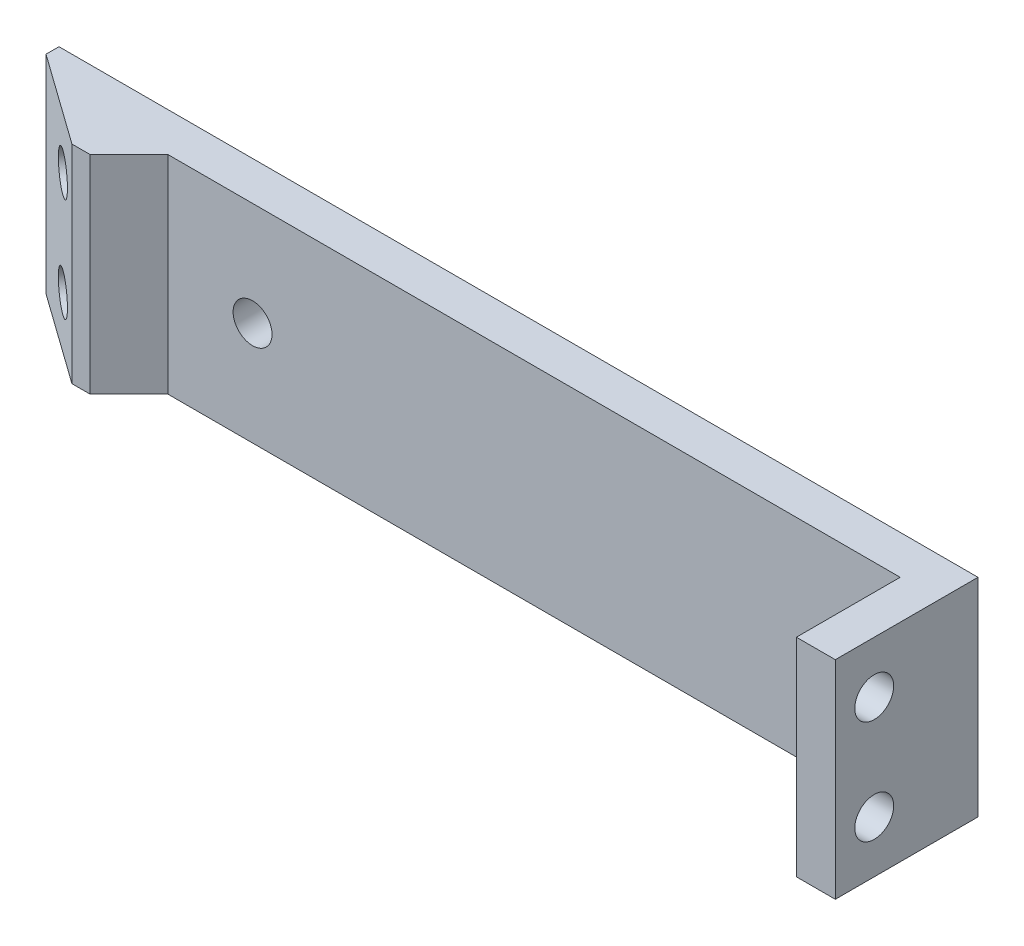
ISO-10303-21;
HEADER;
FILE_DESCRIPTION(('STEP AP214'),'2;1');
FILE_NAME('part.step','',(''),(''),'','','');
FILE_SCHEMA(('AUTOMOTIVE_DESIGN { 1 0 10303 214 1 1 1 1 }'));
ENDSEC;
DATA;
#1=APPLICATION_CONTEXT('core data for automotive mechanical design processes');
#2=APPLICATION_PROTOCOL_DEFINITION('international standard','automotive_design',2000,#1);
#3=PRODUCT_CONTEXT('',#1,'mechanical');
#4=PRODUCT('Part','Part','',(#3));
#5=PRODUCT_RELATED_PRODUCT_CATEGORY('part','',(#4));
#6=PRODUCT_DEFINITION_FORMATION('','',#4);
#7=PRODUCT_DEFINITION_CONTEXT('part definition',#1,'design');
#8=PRODUCT_DEFINITION('design','',#6,#7);
#9=PRODUCT_DEFINITION_SHAPE('','',#8);
#10=(LENGTH_UNIT() NAMED_UNIT(*) SI_UNIT(.MILLI.,.METRE.));
#11=(NAMED_UNIT(*) PLANE_ANGLE_UNIT() SI_UNIT($,.RADIAN.));
#12=(NAMED_UNIT(*) SI_UNIT($,.STERADIAN.) SOLID_ANGLE_UNIT());
#13=UNCERTAINTY_MEASURE_WITH_UNIT(LENGTH_MEASURE(1.E-05),#10,'distance_accuracy_value','');
#14=(GEOMETRIC_REPRESENTATION_CONTEXT(3) GLOBAL_UNCERTAINTY_ASSIGNED_CONTEXT((#13)) GLOBAL_UNIT_ASSIGNED_CONTEXT((#10,
#11,#12)) REPRESENTATION_CONTEXT('',''));
#15=CARTESIAN_POINT('',(0.,0.,0.));
#16=DIRECTION('',(0.,0.,1.));
#17=DIRECTION('',(1.,0.,0.));
#18=AXIS2_PLACEMENT_3D('',#15,#16,#17);
#19=CARTESIAN_POINT('',(0.,0.,3.));
#20=DIRECTION('',(0.,0.,-1.));
#21=DIRECTION('',(-1.,0.,0.));
#22=AXIS2_PLACEMENT_3D('',#19,#20,#21);
#23=PLANE('',#22);
#24=CARTESIAN_POINT('',(-17.5,0.,3.));
#25=DIRECTION('',(0.,0.,-1.));
#26=DIRECTION('',(-1.,0.,0.));
#27=AXIS2_PLACEMENT_3D('',#24,#25,#26);
#28=CIRCLE('',#27,1.5);
#29=CARTESIAN_POINT('',(-19.,0.,3.));
#30=VERTEX_POINT('',#29);
#31=EDGE_CURVE('E362',#30,#30,#28,.T.);
#32=ORIENTED_EDGE('',*,*,#31,.T.);
#33=EDGE_LOOP('',(#32));
#34=FACE_BOUND('',#33,.T.);
#35=DIRECTION('',(0.,-1.,0.));
#36=VECTOR('',#35,1.);
#37=CARTESIAN_POINT('',(32.425,8.,3.));
#38=LINE('',#37,#36);
#39=CARTESIAN_POINT('',(32.425,8.,3.));
#40=VERTEX_POINT('',#39);
#41=CARTESIAN_POINT('',(32.425,-8.,3.));
#42=VERTEX_POINT('',#41);
#43=EDGE_CURVE('E53',#40,#42,#38,.T.);
#44=ORIENTED_EDGE('',*,*,#43,.F.);
#45=DIRECTION('',(-1.,0.,0.));
#46=VECTOR('',#45,1.);
#47=CARTESIAN_POINT('',(-35.425,8.,3.));
#48=LINE('',#47,#46);
#49=CARTESIAN_POINT('',(-24.025,8.,3.));
#50=VERTEX_POINT('',#49);
#51=EDGE_CURVE('E295',#40,#50,#48,.T.);
#52=ORIENTED_EDGE('',*,*,#51,.T.);
#53=DIRECTION('',(0.,-1.,0.));
#54=VECTOR('',#53,1.);
#55=CARTESIAN_POINT('',(-24.025,-8.,3.));
#56=LINE('',#55,#54);
#57=CARTESIAN_POINT('',(-24.025,-8.,3.));
#58=VERTEX_POINT('',#57);
#59=EDGE_CURVE('E319',#50,#58,#56,.T.);
#60=ORIENTED_EDGE('',*,*,#59,.T.);
#61=DIRECTION('',(1.,0.,0.));
#62=VECTOR('',#61,1.);
#63=CARTESIAN_POINT('',(-35.425,-8.,3.));
#64=LINE('',#63,#62);
#65=EDGE_CURVE('E58',#58,#42,#64,.T.);
#66=ORIENTED_EDGE('',*,*,#65,.T.);
#67=EDGE_LOOP('',(#44,#52,#60,#66));
#68=FACE_BOUND('',#67,.T.);
#69=ADVANCED_FACE('F35',(#34,#68),#23,.F.);
#70=CARTESIAN_POINT('',(35.425,-8.,3.));
#71=DIRECTION('',(-1.,0.,0.));
#72=DIRECTION('',(0.,0.,1.));
#73=AXIS2_PLACEMENT_3D('',#70,#71,#72);
#74=PLANE('',#73);
#75=CARTESIAN_POINT('',(35.425,4.,8.));
#76=DIRECTION('',(1.,0.,0.));
#77=DIRECTION('',(0.,0.,-1.));
#78=AXIS2_PLACEMENT_3D('',#75,#76,#77);
#79=CIRCLE('',#78,1.5);
#80=CARTESIAN_POINT('',(35.425,4.,6.5));
#81=VERTEX_POINT('',#80);
#82=EDGE_CURVE('E354',#81,#81,#79,.T.);
#83=ORIENTED_EDGE('',*,*,#82,.F.);
#84=EDGE_LOOP('',(#83));
#85=FACE_BOUND('',#84,.T.);
#86=CARTESIAN_POINT('',(35.425,-4.,8.));
#87=DIRECTION('',(1.,0.,0.));
#88=DIRECTION('',(0.,0.,-1.));
#89=AXIS2_PLACEMENT_3D('',#86,#87,#88);
#90=CIRCLE('',#89,1.5);
#91=CARTESIAN_POINT('',(35.425,-4.,6.5));
#92=VERTEX_POINT('',#91);
#93=EDGE_CURVE('E209',#92,#92,#90,.T.);
#94=ORIENTED_EDGE('',*,*,#93,.F.);
#95=EDGE_LOOP('',(#94));
#96=FACE_BOUND('',#95,.T.);
#97=DIRECTION('',(0.,1.,0.));
#98=VECTOR('',#97,1.);
#99=CARTESIAN_POINT('',(35.425,-8.,0.));
#100=LINE('',#99,#98);
#101=CARTESIAN_POINT('',(35.425,-8.,0.));
#102=VERTEX_POINT('',#101);
#103=CARTESIAN_POINT('',(35.425,8.,0.));
#104=VERTEX_POINT('',#103);
#105=EDGE_CURVE('E186',#102,#104,#100,.T.);
#106=ORIENTED_EDGE('',*,*,#105,.T.);
#107=DIRECTION('',(0.,0.,-1.));
#108=VECTOR('',#107,1.);
#109=CARTESIAN_POINT('',(35.425,8.,3.));
#110=LINE('',#109,#108);
#111=CARTESIAN_POINT('',(35.425,8.,11.));
#112=VERTEX_POINT('',#111);
#113=EDGE_CURVE('E179',#112,#104,#110,.T.);
#114=ORIENTED_EDGE('',*,*,#113,.F.);
#115=DIRECTION('',(0.,1.,0.));
#116=VECTOR('',#115,1.);
#117=CARTESIAN_POINT('',(35.425,8.,11.));
#118=LINE('',#117,#116);
#119=CARTESIAN_POINT('',(35.425,-8.,11.));
#120=VERTEX_POINT('',#119);
#121=EDGE_CURVE('E184',#120,#112,#118,.T.);
#122=ORIENTED_EDGE('',*,*,#121,.F.);
#123=DIRECTION('',(0.,0.,-1.));
#124=VECTOR('',#123,1.);
#125=CARTESIAN_POINT('',(35.425,-8.,3.));
#126=LINE('',#125,#124);
#127=EDGE_CURVE('E299',#120,#102,#126,.T.);
#128=ORIENTED_EDGE('',*,*,#127,.T.);
#129=EDGE_LOOP('',(#106,#114,#122,#128));
#130=FACE_BOUND('',#129,.T.);
#131=ADVANCED_FACE('F181',(#85,#96,#130),#74,.F.);
#132=CARTESIAN_POINT('',(-35.425,8.,3.));
#133=DIRECTION('',(0.,-1.,0.));
#134=DIRECTION('',(0.,0.,-1.));
#135=AXIS2_PLACEMENT_3D('',#132,#133,#134);
#136=PLANE('',#135);
#137=DIRECTION('',(0.,0.,-1.));
#138=VECTOR('',#137,1.);
#139=CARTESIAN_POINT('',(-35.425,8.,3.));
#140=LINE('',#139,#138);
#141=CARTESIAN_POINT('',(-35.425,8.,0.999999999999988));
#142=VERTEX_POINT('',#141);
#143=CARTESIAN_POINT('',(-35.425,8.,0.));
#144=VERTEX_POINT('',#143);
#145=EDGE_CURVE('E190',#142,#144,#140,.T.);
#146=ORIENTED_EDGE('',*,*,#145,.F.);
#147=DIRECTION('',(0.813733471206736,0.,0.581238193719095));
#148=VECTOR('',#147,1.);
#149=CARTESIAN_POINT('',(-28.425,8.,6.));
#150=LINE('',#149,#148);
#151=CARTESIAN_POINT('',(-28.425,8.,6.));
#152=VERTEX_POINT('',#151);
#153=EDGE_CURVE('E317',#142,#152,#150,.T.);
#154=ORIENTED_EDGE('',*,*,#153,.T.);
#155=DIRECTION('',(-1.,0.,0.));
#156=VECTOR('',#155,1.);
#157=CARTESIAN_POINT('',(-35.425,8.,6.));
#158=LINE('',#157,#156);
#159=CARTESIAN_POINT('',(-27.025,8.,6.));
#160=VERTEX_POINT('',#159);
#161=EDGE_CURVE('E292',#160,#152,#158,.T.);
#162=ORIENTED_EDGE('',*,*,#161,.F.);
#163=DIRECTION('',(-0.707106781186546,0.,0.707106781186549));
#164=VECTOR('',#163,1.);
#165=CARTESIAN_POINT('',(-29.725,8.,8.69999999999999));
#166=LINE('',#165,#164);
#167=EDGE_CURVE('E321',#160,#50,#166,.F.);
#168=ORIENTED_EDGE('',*,*,#167,.T.);
#169=ORIENTED_EDGE('',*,*,#51,.F.);
#170=DIRECTION('',(0.,0.,-1.));
#171=VECTOR('',#170,1.);
#172=CARTESIAN_POINT('',(32.425,8.,11.));
#173=LINE('',#172,#171);
#174=CARTESIAN_POINT('',(32.425,8.,11.));
#175=VERTEX_POINT('',#174);
#176=EDGE_CURVE('E197',#175,#40,#173,.T.);
#177=ORIENTED_EDGE('',*,*,#176,.F.);
#178=DIRECTION('',(-1.,0.,0.));
#179=VECTOR('',#178,1.);
#180=CARTESIAN_POINT('',(35.425,8.,11.));
#181=LINE('',#180,#179);
#182=EDGE_CURVE('E193',#112,#175,#181,.T.);
#183=ORIENTED_EDGE('',*,*,#182,.F.);
#184=ORIENTED_EDGE('',*,*,#113,.T.);
#185=DIRECTION('',(-1.,0.,0.));
#186=VECTOR('',#185,1.);
#187=CARTESIAN_POINT('',(-35.425,8.,0.));
#188=LINE('',#187,#186);
#189=EDGE_CURVE('E301',#104,#144,#188,.T.);
#190=ORIENTED_EDGE('',*,*,#189,.T.);
#191=EDGE_LOOP('',(#146,#154,#162,#168,#169,#177,#183,#184,#190));
#192=FACE_BOUND('',#191,.T.);
#193=ADVANCED_FACE('F195',(#192),#136,.F.);
#194=CARTESIAN_POINT('',(-35.425,-8.,3.));
#195=DIRECTION('',(1.,0.,0.));
#196=DIRECTION('',(0.,0.,-1.));
#197=AXIS2_PLACEMENT_3D('',#194,#195,#196);
#198=PLANE('',#197);
#199=DIRECTION('',(0.,0.,-1.));
#200=VECTOR('',#199,1.);
#201=CARTESIAN_POINT('',(-35.425,-8.,3.));
#202=LINE('',#201,#200);
#203=CARTESIAN_POINT('',(-35.425,-8.,0.999999999999988));
#204=VERTEX_POINT('',#203);
#205=CARTESIAN_POINT('',(-35.425,-8.,0.));
#206=VERTEX_POINT('',#205);
#207=EDGE_CURVE('E308',#204,#206,#202,.T.);
#208=ORIENTED_EDGE('',*,*,#207,.F.);
#209=DIRECTION('',(0.,1.,0.));
#210=VECTOR('',#209,1.);
#211=CARTESIAN_POINT('',(-35.425,8.,0.999999999999988));
#212=LINE('',#211,#210);
#213=EDGE_CURVE('E315',#204,#142,#212,.T.);
#214=ORIENTED_EDGE('',*,*,#213,.T.);
#215=ORIENTED_EDGE('',*,*,#145,.T.);
#216=DIRECTION('',(0.,-1.,0.));
#217=VECTOR('',#216,1.);
#218=CARTESIAN_POINT('',(-35.425,-8.,0.));
#219=LINE('',#218,#217);
#220=EDGE_CURVE('E303',#144,#206,#219,.T.);
#221=ORIENTED_EDGE('',*,*,#220,.T.);
#222=EDGE_LOOP('',(#208,#214,#215,#221));
#223=FACE_BOUND('',#222,.T.);
#224=ADVANCED_FACE('F407',(#223),#198,.F.);
#225=CARTESIAN_POINT('',(-35.425,-8.,3.));
#226=DIRECTION('',(0.,1.,0.));
#227=DIRECTION('',(0.,0.,1.));
#228=AXIS2_PLACEMENT_3D('',#225,#226,#227);
#229=PLANE('',#228);
#230=DIRECTION('',(1.,0.,0.));
#231=VECTOR('',#230,1.);
#232=CARTESIAN_POINT('',(-35.425,-8.,6.));
#233=LINE('',#232,#231);
#234=CARTESIAN_POINT('',(-28.425,-8.,6.));
#235=VERTEX_POINT('',#234);
#236=CARTESIAN_POINT('',(-27.025,-8.,6.));
#237=VERTEX_POINT('',#236);
#238=EDGE_CURVE('E282',#235,#237,#233,.T.);
#239=ORIENTED_EDGE('',*,*,#238,.F.);
#240=DIRECTION('',(-0.813733471206736,0.,-0.581238193719095));
#241=VECTOR('',#240,1.);
#242=CARTESIAN_POINT('',(-28.425,-8.,6.));
#243=LINE('',#242,#241);
#244=EDGE_CURVE('E313',#235,#204,#243,.T.);
#245=ORIENTED_EDGE('',*,*,#244,.T.);
#246=ORIENTED_EDGE('',*,*,#207,.T.);
#247=DIRECTION('',(1.,0.,0.));
#248=VECTOR('',#247,1.);
#249=CARTESIAN_POINT('',(-35.425,-8.,0.));
#250=LINE('',#249,#248);
#251=EDGE_CURVE('E297',#206,#102,#250,.T.);
#252=ORIENTED_EDGE('',*,*,#251,.T.);
#253=ORIENTED_EDGE('',*,*,#127,.F.);
#254=DIRECTION('',(1.,0.,0.));
#255=VECTOR('',#254,1.);
#256=CARTESIAN_POINT('',(35.425,-8.,11.));
#257=LINE('',#256,#255);
#258=CARTESIAN_POINT('',(32.425,-8.,11.));
#259=VERTEX_POINT('',#258);
#260=EDGE_CURVE('E205',#259,#120,#257,.T.);
#261=ORIENTED_EDGE('',*,*,#260,.F.);
#262=DIRECTION('',(0.,0.,-1.));
#263=VECTOR('',#262,1.);
#264=CARTESIAN_POINT('',(32.425,-8.,11.));
#265=LINE('',#264,#263);
#266=EDGE_CURVE('E213',#259,#42,#265,.T.);
#267=ORIENTED_EDGE('',*,*,#266,.T.);
#268=ORIENTED_EDGE('',*,*,#65,.F.);
#269=DIRECTION('',(0.707106781186546,0.,-0.707106781186549));
#270=VECTOR('',#269,1.);
#271=CARTESIAN_POINT('',(-29.725,-8.,8.69999999999999));
#272=LINE('',#271,#270);
#273=EDGE_CURVE('E324',#58,#237,#272,.F.);
#274=ORIENTED_EDGE('',*,*,#273,.T.);
#275=EDGE_LOOP('',(#239,#245,#246,#252,#253,#261,#267,#268,#274));
#276=FACE_BOUND('',#275,.T.);
#277=ADVANCED_FACE('F377',(#276),#229,.F.);
#278=CARTESIAN_POINT('',(0.,0.,0.));
#279=DIRECTION('',(0.,0.,-1.));
#280=DIRECTION('',(-1.,0.,0.));
#281=AXIS2_PLACEMENT_3D('',#278,#279,#280);
#282=PLANE('',#281);
#283=CARTESIAN_POINT('',(-17.5,0.,0.));
#284=DIRECTION('',(0.,0.,-1.));
#285=DIRECTION('',(-1.,0.,0.));
#286=AXIS2_PLACEMENT_3D('',#283,#284,#285);
#287=CIRCLE('',#286,1.5);
#288=CARTESIAN_POINT('',(-19.,0.,0.));
#289=VERTEX_POINT('',#288);
#290=EDGE_CURVE('E366',#289,#289,#287,.T.);
#291=ORIENTED_EDGE('',*,*,#290,.F.);
#292=EDGE_LOOP('',(#291));
#293=FACE_BOUND('',#292,.T.);
#294=DIRECTION('',(1.,0.,0.));
#295=VECTOR('',#294,1.);
#296=CARTESIAN_POINT('',(0.,6.75000000000001,0.));
#297=LINE('',#296,#295);
#298=CARTESIAN_POINT('',(-29.7771430749619,6.75,0.));
#299=VERTEX_POINT('',#298);
#300=CARTESIAN_POINT('',(-25.8748500110746,6.75,0.));
#301=VERTEX_POINT('',#300);
#302=EDGE_CURVE('E11',#299,#301,#297,.T.);
#303=ORIENTED_EDGE('',*,*,#302,.F.);
#304=DIRECTION('',(0.578655017224664,0.815572419249649,0.));
#305=VECTOR('',#304,1.);
#306=CARTESIAN_POINT('',(-22.9920777200731,16.3130591657087,0.));
#307=LINE('',#306,#305);
#308=CARTESIAN_POINT('',(-31.6636048397744,4.09116850359432,0.));
#309=VERTEX_POINT('',#308);
#310=EDGE_CURVE('E343',#309,#299,#307,.T.);
#311=ORIENTED_EDGE('',*,*,#310,.F.);
#312=DIRECTION('',(0.,1.,0.));
#313=VECTOR('',#312,1.);
#314=CARTESIAN_POINT('',(-31.6636048397744,0.,0.));
#315=LINE('',#314,#313);
#316=CARTESIAN_POINT('',(-31.6636048397744,3.90883149640569,0.));
#317=VERTEX_POINT('',#316);
#318=EDGE_CURVE('E341',#317,#309,#315,.T.);
#319=ORIENTED_EDGE('',*,*,#318,.F.);
#320=DIRECTION('',(-0.578655017224664,0.815572419249648,0.));
#321=VECTOR('',#320,1.);
#322=CARTESIAN_POINT('',(-19.2165971416021,-13.6343261340345,0.));
#323=LINE('',#322,#321);
#324=CARTESIAN_POINT('',(-29.7771430749618,1.25,0.));
#325=VERTEX_POINT('',#324);
#326=EDGE_CURVE('E345',#325,#317,#323,.T.);
#327=ORIENTED_EDGE('',*,*,#326,.F.);
#328=DIRECTION('',(-1.,0.,0.));
#329=VECTOR('',#328,1.);
#330=CARTESIAN_POINT('',(0.,1.25,0.));
#331=LINE('',#330,#329);
#332=CARTESIAN_POINT('',(-25.8748500110746,1.25,0.));
#333=VERTEX_POINT('',#332);
#334=EDGE_CURVE('E348',#333,#325,#331,.T.);
#335=ORIENTED_EDGE('',*,*,#334,.F.);
#336=DIRECTION('',(-0.578655017224663,-0.815572419249649,0.));
#337=VECTOR('',#336,1.);
#338=CARTESIAN_POINT('',(-17.8007919246755,12.6298012471566,0.));
#339=LINE('',#338,#337);
#340=CARTESIAN_POINT('',(-23.923703479131,4.00000000000001,0.));
#341=VERTEX_POINT('',#340);
#342=EDGE_CURVE('E350',#341,#333,#339,.T.);
#343=ORIENTED_EDGE('',*,*,#342,.F.);
#344=DIRECTION('',(0.578655017224664,-0.815572419249648,0.));
#345=VECTOR('',#344,1.);
#346=CARTESIAN_POINT('',(-14.0253113462046,-9.95106821548243,0.));
#347=LINE('',#346,#345);
#348=EDGE_CURVE('E45',#301,#341,#347,.T.);
#349=ORIENTED_EDGE('',*,*,#348,.F.);
#350=EDGE_LOOP('',(#303,#311,#319,#327,#335,#343,#349));
#351=FACE_BOUND('',#350,.T.);
#352=DIRECTION('',(1.,0.,0.));
#353=VECTOR('',#352,1.);
#354=CARTESIAN_POINT('',(0.,-1.25,0.));
#355=LINE('',#354,#353);
#356=CARTESIAN_POINT('',(-29.7771430749619,-1.25,0.));
#357=VERTEX_POINT('',#356);
#358=CARTESIAN_POINT('',(-25.8748500110746,-1.25,0.));
#359=VERTEX_POINT('',#358);
#360=EDGE_CURVE('E339',#357,#359,#355,.T.);
#361=ORIENTED_EDGE('',*,*,#360,.F.);
#362=DIRECTION('',(0.578655017224664,0.815572419249648,0.));
#363=VECTOR('',#362,1.);
#364=CARTESIAN_POINT('',(-19.2165971416021,13.6343261340345,0.));
#365=LINE('',#364,#363);
#366=CARTESIAN_POINT('',(-31.6636048397744,-3.90883149640568,0.));
#367=VERTEX_POINT('',#366);
#368=EDGE_CURVE('E328',#367,#357,#365,.T.);
#369=ORIENTED_EDGE('',*,*,#368,.F.);
#370=DIRECTION('',(0.,1.,0.));
#371=VECTOR('',#370,1.);
#372=CARTESIAN_POINT('',(-31.6636048397744,0.,0.));
#373=LINE('',#372,#371);
#374=CARTESIAN_POINT('',(-31.6636048397744,-4.0911685035943,0.));
#375=VERTEX_POINT('',#374);
#376=EDGE_CURVE('E326',#375,#367,#373,.T.);
#377=ORIENTED_EDGE('',*,*,#376,.F.);
#378=DIRECTION('',(-0.578655017224665,0.815572419249648,0.));
#379=VECTOR('',#378,1.);
#380=CARTESIAN_POINT('',(-22.992077720073,-16.3130591657087,0.));
#381=LINE('',#380,#379);
#382=CARTESIAN_POINT('',(-29.7771430749618,-6.74999999999999,0.));
#383=VERTEX_POINT('',#382);
#384=EDGE_CURVE('E330',#383,#375,#381,.T.);
#385=ORIENTED_EDGE('',*,*,#384,.F.);
#386=DIRECTION('',(-1.,0.,0.));
#387=VECTOR('',#386,1.);
#388=CARTESIAN_POINT('',(0.,-6.74999999999999,0.));
#389=LINE('',#388,#387);
#390=CARTESIAN_POINT('',(-25.8748500110746,-6.74999999999999,0.));
#391=VERTEX_POINT('',#390);
#392=EDGE_CURVE('E333',#391,#383,#389,.T.);
#393=ORIENTED_EDGE('',*,*,#392,.F.);
#394=DIRECTION('',(-0.578655017224663,-0.815572419249649,0.));
#395=VECTOR('',#394,1.);
#396=CARTESIAN_POINT('',(-14.0253113462046,9.95106821548244,0.));
#397=LINE('',#396,#395);
#398=CARTESIAN_POINT('',(-23.923703479131,-4.,0.));
#399=VERTEX_POINT('',#398);
#400=EDGE_CURVE('E335',#399,#391,#397,.T.);
#401=ORIENTED_EDGE('',*,*,#400,.F.);
#402=DIRECTION('',(0.578655017224663,-0.815572419249649,0.));
#403=VECTOR('',#402,1.);
#404=CARTESIAN_POINT('',(-17.8007919246756,-12.6298012471566,0.));
#405=LINE('',#404,#403);
#406=EDGE_CURVE('E337',#359,#399,#405,.T.);
#407=ORIENTED_EDGE('',*,*,#406,.F.);
#408=EDGE_LOOP('',(#361,#369,#377,#385,#393,#401,#407));
#409=FACE_BOUND('',#408,.T.);
#410=ORIENTED_EDGE('',*,*,#105,.F.);
#411=ORIENTED_EDGE('',*,*,#251,.F.);
#412=ORIENTED_EDGE('',*,*,#220,.F.);
#413=ORIENTED_EDGE('',*,*,#189,.F.);
#414=EDGE_LOOP('',(#410,#411,#412,#413));
#415=FACE_BOUND('',#414,.T.);
#416=ADVANCED_FACE('F373',(#293,#351,#409,#415),#282,.T.);
#417=CARTESIAN_POINT('',(0.,0.,6.));
#418=DIRECTION('',(0.,0.,1.));
#419=DIRECTION('',(1.,0.,0.));
#420=AXIS2_PLACEMENT_3D('',#417,#418,#419);
#421=PLANE('',#420);
#422=ORIENTED_EDGE('',*,*,#161,.T.);
#423=DIRECTION('',(0.,-1.,0.));
#424=VECTOR('',#423,1.);
#425=CARTESIAN_POINT('',(-28.425,-8.,6.));
#426=LINE('',#425,#424);
#427=EDGE_CURVE('E189',#152,#235,#426,.T.);
#428=ORIENTED_EDGE('',*,*,#427,.T.);
#429=ORIENTED_EDGE('',*,*,#238,.T.);
#430=DIRECTION('',(0.,1.,0.));
#431=VECTOR('',#430,1.);
#432=CARTESIAN_POINT('',(-27.025,8.,6.));
#433=LINE('',#432,#431);
#434=EDGE_CURVE('E289',#237,#160,#433,.T.);
#435=ORIENTED_EDGE('',*,*,#434,.T.);
#436=EDGE_LOOP('',(#422,#428,#429,#435));
#437=FACE_BOUND('',#436,.T.);
#438=ADVANCED_FACE('F376',(#437),#421,.T.);
#439=CARTESIAN_POINT('',(-28.425,0.,6.));
#440=DIRECTION('',(-0.581238193719095,0.,0.813733471206736));
#441=DIRECTION('',(0.,1.,0.));
#442=AXIS2_PLACEMENT_3D('',#439,#440,#441);
#443=PLANE('',#442);
#444=CARTESIAN_POINT('',(-30.8662004136202,4.,4.2562854188427));
#445=DIRECTION('',(-0.581238193719096,0.,0.813733471206735));
#446=DIRECTION('',(0.813733471206735,0.,0.581238193719096));
#447=AXIS2_PLACEMENT_3D('',#444,#445,#446);
#448=CIRCLE('',#447,1.5);
#449=CARTESIAN_POINT('',(-29.64560020681,4.,5.12814270942134));
#450=VERTEX_POINT('',#449);
#451=EDGE_CURVE('E279',#450,#450,#448,.T.);
#452=ORIENTED_EDGE('',*,*,#451,.F.);
#453=EDGE_LOOP('',(#452));
#454=FACE_BOUND('',#453,.T.);
#455=CARTESIAN_POINT('',(-30.8662004136202,-4.,4.2562854188427));
#456=DIRECTION('',(-0.581238193719096,0.,0.813733471206735));
#457=DIRECTION('',(0.813733471206735,0.,0.581238193719096));
#458=AXIS2_PLACEMENT_3D('',#455,#456,#457);
#459=CIRCLE('',#458,1.5);
#460=CARTESIAN_POINT('',(-29.64560020681,-4.,5.12814270942134));
#461=VERTEX_POINT('',#460);
#462=EDGE_CURVE('E278',#461,#461,#459,.T.);
#463=ORIENTED_EDGE('',*,*,#462,.F.);
#464=EDGE_LOOP('',(#463));
#465=FACE_BOUND('',#464,.T.);
#466=ORIENTED_EDGE('',*,*,#153,.F.);
#467=ORIENTED_EDGE('',*,*,#213,.F.);
#468=ORIENTED_EDGE('',*,*,#244,.F.);
#469=ORIENTED_EDGE('',*,*,#427,.F.);
#470=EDGE_LOOP('',(#466,#467,#468,#469));
#471=FACE_BOUND('',#470,.T.);
#472=ADVANCED_FACE('F395',(#454,#465,#471),#443,.T.);
#473=CARTESIAN_POINT('',(-29.1224858324629,-4.,1.81508500522249));
#474=DIRECTION('',(-0.581238193719096,0.,0.813733471206735));
#475=DIRECTION('',(0.813733471206735,0.,0.581238193719096));
#476=AXIS2_PLACEMENT_3D('',#473,#474,#475);
#477=CYLINDRICAL_SURFACE('',#476,1.5);
#478=CARTESIAN_POINT('',(-29.1224858324629,-4.,1.81508500522249));
#479=DIRECTION('',(-0.581238193719096,0.,0.813733471206735));
#480=DIRECTION('',(0.813733471206735,0.,0.581238193719096));
#481=AXIS2_PLACEMENT_3D('',#478,#479,#480);
#482=CIRCLE('',#481,1.5);
#483=CARTESIAN_POINT('',(-27.9018856256528,-4.,2.68694229580113));
#484=VERTEX_POINT('',#483);
#485=EDGE_CURVE('E241',#484,#484,#482,.T.);
#486=ORIENTED_EDGE('',*,*,#485,.F.);
#487=EDGE_LOOP('',(#486));
#488=FACE_BOUND('',#487,.T.);
#489=ORIENTED_EDGE('',*,*,#462,.T.);
#490=EDGE_LOOP('',(#489));
#491=FACE_BOUND('',#490,.T.);
#492=ADVANCED_FACE('F427',(#488,#491),#477,.F.);
#493=CARTESIAN_POINT('',(-29.1224858324629,4.,1.81508500522249));
#494=DIRECTION('',(-0.581238193719096,0.,0.813733471206735));
#495=DIRECTION('',(0.813733471206735,0.,0.581238193719096));
#496=AXIS2_PLACEMENT_3D('',#493,#494,#495);
#497=CYLINDRICAL_SURFACE('',#496,1.5);
#498=CARTESIAN_POINT('',(-29.1224858324629,4.,1.81508500522249));
#499=DIRECTION('',(-0.581238193719096,0.,0.813733471206735));
#500=DIRECTION('',(0.813733471206735,0.,0.581238193719096));
#501=AXIS2_PLACEMENT_3D('',#498,#499,#500);
#502=CIRCLE('',#501,1.5);
#503=CARTESIAN_POINT('',(-27.9018856256528,4.,2.68694229580113));
#504=VERTEX_POINT('',#503);
#505=EDGE_CURVE('E275',#504,#504,#502,.T.);
#506=ORIENTED_EDGE('',*,*,#505,.F.);
#507=EDGE_LOOP('',(#506));
#508=FACE_BOUND('',#507,.T.);
#509=ORIENTED_EDGE('',*,*,#451,.T.);
#510=EDGE_LOOP('',(#509));
#511=FACE_BOUND('',#510,.T.);
#512=ADVANCED_FACE('F430',(#508,#511),#497,.F.);
#513=CARTESIAN_POINT('',(-27.025,8.,6.));
#514=DIRECTION('',(0.707106781186549,0.,0.707106781186546));
#515=DIRECTION('',(0.,-1.,0.));
#516=AXIS2_PLACEMENT_3D('',#513,#514,#515);
#517=PLANE('',#516);
#518=ORIENTED_EDGE('',*,*,#273,.F.);
#519=ORIENTED_EDGE('',*,*,#59,.F.);
#520=ORIENTED_EDGE('',*,*,#167,.F.);
#521=ORIENTED_EDGE('',*,*,#434,.F.);
#522=EDGE_LOOP('',(#518,#519,#520,#521));
#523=FACE_BOUND('',#522,.T.);
#524=ADVANCED_FACE('F38',(#523),#517,.T.);
#525=CARTESIAN_POINT('',(-23.1806048764231,-6.74999999999999,-3.77194318851211));
#526=DIRECTION('',(0.704713857974726,-0.499999999999999,0.503367041410518));
#527=DIRECTION('',(0.581238193719096,0.,-0.813733471206735));
#528=AXIS2_PLACEMENT_3D('',#525,#526,#527);
#529=PLANE('',#528);
#530=ORIENTED_EDGE('',*,*,#400,.T.);
#531=DIRECTION('',(-0.581238193719096,0.,0.813733471206735));
#532=VECTOR('',#531,1.);
#533=CARTESIAN_POINT('',(-23.1806048764231,-6.74999999999999,-3.77194318851211));
#534=LINE('',#533,#532);
#535=CARTESIAN_POINT('',(-27.8305104261759,-6.74999999999999,2.73792458114178));
#536=VERTEX_POINT('',#535);
#537=EDGE_CURVE('E223',#391,#536,#534,.T.);
#538=ORIENTED_EDGE('',*,*,#537,.T.);
#539=DIRECTION('',(0.406866735603367,0.866025403784439,0.290619096859548));
#540=VECTOR('',#539,1.);
#541=CARTESIAN_POINT('',(-27.8305104261759,-6.74999999999999,2.73792458114178));
#542=LINE('',#541,#540);
#543=CARTESIAN_POINT('',(-26.5385350198889,-3.99999999999999,3.66076415706106));
#544=VERTEX_POINT('',#543);
#545=EDGE_CURVE('E218',#536,#544,#542,.T.);
#546=ORIENTED_EDGE('',*,*,#545,.T.);
#547=DIRECTION('',(-0.581238193719096,0.,0.813733471206735));
#548=VECTOR('',#547,1.);
#549=CARTESIAN_POINT('',(-21.8886294701361,-3.99999999999999,-2.84910361259282));
#550=LINE('',#549,#548);
#551=EDGE_CURVE('E266',#399,#544,#550,.T.);
#552=ORIENTED_EDGE('',*,*,#551,.F.);
#553=EDGE_LOOP('',(#530,#538,#546,#552));
#554=FACE_BOUND('',#553,.T.);
#555=ADVANCED_FACE('F435',(#554),#529,.F.);
#556=CARTESIAN_POINT('',(-25.7645556889971,-6.74999999999999,-5.61762234035067));
#557=DIRECTION('',(0.,-1.,0.));
#558=DIRECTION('',(0.,0.,-1.));
#559=AXIS2_PLACEMENT_3D('',#556,#557,#558);
#560=PLANE('',#559);
#561=ORIENTED_EDGE('',*,*,#392,.T.);
#562=DIRECTION('',(-0.581238193719096,0.,0.813733471206735));
#563=VECTOR('',#562,1.);
#564=CARTESIAN_POINT('',(-25.7645556889971,-6.74999999999999,-5.61762234035067));
#565=LINE('',#564,#563);
#566=CARTESIAN_POINT('',(-30.4144612387499,-6.74999999999999,0.892245429303217));
#567=VERTEX_POINT('',#566);
#568=EDGE_CURVE('E268',#383,#567,#565,.T.);
#569=ORIENTED_EDGE('',*,*,#568,.T.);
#570=DIRECTION('',(0.813733471206735,0.,0.581238193719096));
#571=VECTOR('',#570,1.);
#572=CARTESIAN_POINT('',(-30.4144612387499,-6.74999999999999,0.892245429303217));
#573=LINE('',#572,#571);
#574=EDGE_CURVE('E263',#567,#536,#573,.T.);
#575=ORIENTED_EDGE('',*,*,#574,.T.);
#576=ORIENTED_EDGE('',*,*,#537,.F.);
#577=EDGE_LOOP('',(#561,#569,#575,#576));
#578=FACE_BOUND('',#577,.T.);
#579=ADVANCED_FACE('F438',(#578),#560,.F.);
#580=CARTESIAN_POINT('',(-27.0565310952841,-3.99999999999999,-6.54046191626995));
#581=DIRECTION('',(-0.704713857974725,-0.500000000000001,-0.503367041410517));
#582=DIRECTION('',(-0.581238193719096,0.,0.813733471206735));
#583=AXIS2_PLACEMENT_3D('',#580,#581,#582);
#584=PLANE('',#583);
#585=ORIENTED_EDGE('',*,*,#384,.T.);
#586=DIRECTION('',(0.40686673560337,-0.866025403784438,0.290619096859547));
#587=VECTOR('',#586,1.);
#588=CARTESIAN_POINT('',(-31.7064366450369,-3.99999999999999,-0.030594146616064));
#589=LINE('',#588,#587);
#590=EDGE_CURVE('E260',#375,#567,#589,.T.);
#591=ORIENTED_EDGE('',*,*,#590,.T.);
#592=ORIENTED_EDGE('',*,*,#568,.F.);
#593=EDGE_LOOP('',(#585,#591,#592));
#594=FACE_BOUND('',#593,.T.);
#595=ADVANCED_FACE('F452',(#594),#584,.F.);
#596=CARTESIAN_POINT('',(-25.7645556889971,-1.25,-5.61762234035067));
#597=DIRECTION('',(-0.704713857974726,0.500000000000001,-0.503367041410517));
#598=DIRECTION('',(-0.581238193719096,0.,0.813733471206735));
#599=AXIS2_PLACEMENT_3D('',#596,#597,#598);
#600=PLANE('',#599);
#601=ORIENTED_EDGE('',*,*,#368,.T.);
#602=DIRECTION('',(-0.581238193719096,0.,0.813733471206735));
#603=VECTOR('',#602,1.);
#604=CARTESIAN_POINT('',(-25.7645556889971,-1.25,-5.61762234035067));
#605=LINE('',#604,#603);
#606=CARTESIAN_POINT('',(-30.4144612387499,-1.25,0.892245429303215));
#607=VERTEX_POINT('',#606);
#608=EDGE_CURVE('E270',#357,#607,#605,.T.);
#609=ORIENTED_EDGE('',*,*,#608,.T.);
#610=DIRECTION('',(-0.406866735603369,-0.866025403784438,-0.290619096859548));
#611=VECTOR('',#610,1.);
#612=CARTESIAN_POINT('',(-30.4144612387499,-1.25,0.892245429303215));
#613=LINE('',#612,#611);
#614=EDGE_CURVE('E257',#607,#367,#613,.T.);
#615=ORIENTED_EDGE('',*,*,#614,.T.);
#616=EDGE_LOOP('',(#601,#609,#615));
#617=FACE_BOUND('',#616,.T.);
#618=ADVANCED_FACE('F448',(#617),#600,.F.);
#619=CARTESIAN_POINT('',(-23.1806048764231,-1.25,-3.7719431885121));
#620=DIRECTION('',(0.,1.,0.));
#621=DIRECTION('',(-1.,0.,0.));
#622=AXIS2_PLACEMENT_3D('',#619,#620,#621);
#623=PLANE('',#622);
#624=ORIENTED_EDGE('',*,*,#360,.T.);
#625=DIRECTION('',(-0.581238193719096,0.,0.813733471206735));
#626=VECTOR('',#625,1.);
#627=CARTESIAN_POINT('',(-23.1806048764231,-1.25,-3.7719431885121));
#628=LINE('',#627,#626);
#629=CARTESIAN_POINT('',(-27.8305104261759,-1.25,2.73792458114178));
#630=VERTEX_POINT('',#629);
#631=EDGE_CURVE('E272',#359,#630,#628,.T.);
#632=ORIENTED_EDGE('',*,*,#631,.T.);
#633=DIRECTION('',(-0.813733471206735,0.,-0.581238193719096));
#634=VECTOR('',#633,1.);
#635=CARTESIAN_POINT('',(-27.8305104261759,-1.25,2.73792458114178));
#636=LINE('',#635,#634);
#637=EDGE_CURVE('E254',#630,#607,#636,.T.);
#638=ORIENTED_EDGE('',*,*,#637,.T.);
#639=ORIENTED_EDGE('',*,*,#608,.F.);
#640=EDGE_LOOP('',(#624,#632,#638,#639));
#641=FACE_BOUND('',#640,.T.);
#642=ADVANCED_FACE('F444',(#641),#623,.F.);
#643=CARTESIAN_POINT('',(-21.8886294701361,-3.99999999999999,-2.84910361259282));
#644=DIRECTION('',(0.704713857974726,0.499999999999999,0.503367041410518));
#645=DIRECTION('',(0.581238193719096,0.,-0.813733471206735));
#646=AXIS2_PLACEMENT_3D('',#643,#644,#645);
#647=PLANE('',#646);
#648=ORIENTED_EDGE('',*,*,#406,.T.);
#649=ORIENTED_EDGE('',*,*,#551,.T.);
#650=DIRECTION('',(-0.406866735603367,0.866025403784439,-0.290619096859547));
#651=VECTOR('',#650,1.);
#652=CARTESIAN_POINT('',(-26.5385350198889,-3.99999999999999,3.66076415706106));
#653=LINE('',#652,#651);
#654=EDGE_CURVE('E251',#544,#630,#653,.T.);
#655=ORIENTED_EDGE('',*,*,#654,.T.);
#656=ORIENTED_EDGE('',*,*,#631,.F.);
#657=EDGE_LOOP('',(#648,#649,#655,#656));
#658=FACE_BOUND('',#657,.T.);
#659=ADVANCED_FACE('F440',(#658),#647,.F.);
#660=CARTESIAN_POINT('',(-10.6971637972211,0.,14.9760293161095));
#661=DIRECTION('',(-0.581238193719096,0.,0.813733471206735));
#662=DIRECTION('',(0.813733471206735,0.,0.581238193719096));
#663=AXIS2_PLACEMENT_3D('',#660,#661,#662);
#664=PLANE('',#663);
#665=ORIENTED_EDGE('',*,*,#485,.T.);
#666=EDGE_LOOP('',(#665));
#667=FACE_BOUND('',#666,.T.);
#668=ORIENTED_EDGE('',*,*,#376,.T.);
#669=ORIENTED_EDGE('',*,*,#614,.F.);
#670=ORIENTED_EDGE('',*,*,#637,.F.);
#671=ORIENTED_EDGE('',*,*,#654,.F.);
#672=ORIENTED_EDGE('',*,*,#545,.F.);
#673=ORIENTED_EDGE('',*,*,#574,.F.);
#674=ORIENTED_EDGE('',*,*,#590,.F.);
#675=EDGE_LOOP('',(#668,#669,#670,#671,#672,#673,#674));
#676=FACE_BOUND('',#675,.T.);
#677=ADVANCED_FACE('F443',(#667,#676),#664,.F.);
#678=CARTESIAN_POINT('',(-23.1806048764231,1.25,-3.77194318851211));
#679=DIRECTION('',(0.704713857974726,-0.5,0.503367041410518));
#680=DIRECTION('',(0.581238193719096,0.,-0.813733471206735));
#681=AXIS2_PLACEMENT_3D('',#678,#679,#680);
#682=PLANE('',#681);
#683=ORIENTED_EDGE('',*,*,#342,.T.);
#684=DIRECTION('',(-0.581238193719096,0.,0.813733471206735));
#685=VECTOR('',#684,1.);
#686=CARTESIAN_POINT('',(-23.1806048764231,1.25,-3.77194318851211));
#687=LINE('',#686,#685);
#688=CARTESIAN_POINT('',(-27.8305104261759,1.25,2.73792458114178));
#689=VERTEX_POINT('',#688);
#690=EDGE_CURVE('E239',#333,#689,#687,.T.);
#691=ORIENTED_EDGE('',*,*,#690,.T.);
#692=DIRECTION('',(0.406866735603367,0.866025403784439,0.290619096859548));
#693=VECTOR('',#692,1.);
#694=CARTESIAN_POINT('',(-27.8305104261759,1.25,2.73792458114178));
#695=LINE('',#694,#693);
#696=CARTESIAN_POINT('',(-26.5385350198889,4.00000000000001,3.66076415706106));
#697=VERTEX_POINT('',#696);
#698=EDGE_CURVE('E219',#689,#697,#695,.T.);
#699=ORIENTED_EDGE('',*,*,#698,.T.);
#700=DIRECTION('',(-0.581238193719096,0.,0.813733471206735));
#701=VECTOR('',#700,1.);
#702=CARTESIAN_POINT('',(-21.8886294701361,4.00000000000001,-2.84910361259282));
#703=LINE('',#702,#701);
#704=EDGE_CURVE('E238',#341,#697,#703,.T.);
#705=ORIENTED_EDGE('',*,*,#704,.F.);
#706=EDGE_LOOP('',(#683,#691,#699,#705));
#707=FACE_BOUND('',#706,.T.);
#708=ADVANCED_FACE('F462',(#707),#682,.F.);
#709=CARTESIAN_POINT('',(-25.7645556889971,1.25,-5.61762234035067));
#710=DIRECTION('',(0.,-1.,0.));
#711=DIRECTION('',(1.,0.,0.));
#712=AXIS2_PLACEMENT_3D('',#709,#710,#711);
#713=PLANE('',#712);
#714=ORIENTED_EDGE('',*,*,#334,.T.);
#715=DIRECTION('',(-0.581238193719096,0.,0.813733471206735));
#716=VECTOR('',#715,1.);
#717=CARTESIAN_POINT('',(-25.7645556889971,1.25,-5.61762234035067));
#718=LINE('',#717,#716);
#719=CARTESIAN_POINT('',(-30.4144612387499,1.25,0.892245429303215));
#720=VERTEX_POINT('',#719);
#721=EDGE_CURVE('E242',#325,#720,#718,.T.);
#722=ORIENTED_EDGE('',*,*,#721,.T.);
#723=DIRECTION('',(0.813733471206736,0.,0.581238193719096));
#724=VECTOR('',#723,1.);
#725=CARTESIAN_POINT('',(-30.4144612387499,1.25,0.892245429303215));
#726=LINE('',#725,#724);
#727=EDGE_CURVE('E235',#720,#689,#726,.T.);
#728=ORIENTED_EDGE('',*,*,#727,.T.);
#729=ORIENTED_EDGE('',*,*,#690,.F.);
#730=EDGE_LOOP('',(#714,#722,#728,#729));
#731=FACE_BOUND('',#730,.T.);
#732=ADVANCED_FACE('F466',(#731),#713,.F.);
#733=CARTESIAN_POINT('',(-27.0565310952841,4.,-6.54046191626995));
#734=DIRECTION('',(-0.704713857974726,-0.5,-0.503367041410518));
#735=DIRECTION('',(-0.581238193719096,0.,0.813733471206735));
#736=AXIS2_PLACEMENT_3D('',#733,#734,#735);
#737=PLANE('',#736);
#738=ORIENTED_EDGE('',*,*,#326,.T.);
#739=DIRECTION('',(0.406866735603368,-0.866025403784439,0.290619096859547));
#740=VECTOR('',#739,1.);
#741=CARTESIAN_POINT('',(-31.7064366450369,4.,-0.030594146616064));
#742=LINE('',#741,#740);
#743=EDGE_CURVE('E232',#317,#720,#742,.T.);
#744=ORIENTED_EDGE('',*,*,#743,.T.);
#745=ORIENTED_EDGE('',*,*,#721,.F.);
#746=EDGE_LOOP('',(#738,#744,#745));
#747=FACE_BOUND('',#746,.T.);
#748=ADVANCED_FACE('F480',(#747),#737,.F.);
#749=CARTESIAN_POINT('',(-25.7645556889971,6.75,-5.61762234035067));
#750=DIRECTION('',(-0.704713857974726,0.5,-0.503367041410518));
#751=DIRECTION('',(-0.581238193719096,0.,0.813733471206735));
#752=AXIS2_PLACEMENT_3D('',#749,#750,#751);
#753=PLANE('',#752);
#754=ORIENTED_EDGE('',*,*,#310,.T.);
#755=DIRECTION('',(-0.581238193719096,0.,0.813733471206735));
#756=VECTOR('',#755,1.);
#757=CARTESIAN_POINT('',(-25.7645556889971,6.75,-5.61762234035067));
#758=LINE('',#757,#756);
#759=CARTESIAN_POINT('',(-30.4144612387499,6.75,0.892245429303215));
#760=VERTEX_POINT('',#759);
#761=EDGE_CURVE('E244',#299,#760,#758,.T.);
#762=ORIENTED_EDGE('',*,*,#761,.T.);
#763=DIRECTION('',(-0.406866735603368,-0.866025403784439,-0.290619096859547));
#764=VECTOR('',#763,1.);
#765=CARTESIAN_POINT('',(-30.4144612387499,6.75,0.892245429303215));
#766=LINE('',#765,#764);
#767=EDGE_CURVE('E229',#760,#309,#766,.T.);
#768=ORIENTED_EDGE('',*,*,#767,.T.);
#769=EDGE_LOOP('',(#754,#762,#768));
#770=FACE_BOUND('',#769,.T.);
#771=ADVANCED_FACE('F476',(#770),#753,.F.);
#772=CARTESIAN_POINT('',(-23.1806048764231,6.75,-3.7719431885121));
#773=DIRECTION('',(0.,1.,0.));
#774=DIRECTION('',(-1.,0.,0.));
#775=AXIS2_PLACEMENT_3D('',#772,#773,#774);
#776=PLANE('',#775);
#777=ORIENTED_EDGE('',*,*,#302,.T.);
#778=DIRECTION('',(-0.581238193719096,0.,0.813733471206735));
#779=VECTOR('',#778,1.);
#780=CARTESIAN_POINT('',(-23.1806048764231,6.75,-3.7719431885121));
#781=LINE('',#780,#779);
#782=CARTESIAN_POINT('',(-27.8305104261759,6.75,2.73792458114178));
#783=VERTEX_POINT('',#782);
#784=EDGE_CURVE('E246',#301,#783,#781,.T.);
#785=ORIENTED_EDGE('',*,*,#784,.T.);
#786=DIRECTION('',(-0.813733471206735,0.,-0.581238193719096));
#787=VECTOR('',#786,1.);
#788=CARTESIAN_POINT('',(-27.8305104261759,6.75,2.73792458114178));
#789=LINE('',#788,#787);
#790=EDGE_CURVE('E226',#783,#760,#789,.T.);
#791=ORIENTED_EDGE('',*,*,#790,.T.);
#792=ORIENTED_EDGE('',*,*,#761,.F.);
#793=EDGE_LOOP('',(#777,#785,#791,#792));
#794=FACE_BOUND('',#793,.T.);
#795=ADVANCED_FACE('F472',(#794),#776,.F.);
#796=CARTESIAN_POINT('',(-21.8886294701361,4.00000000000001,-2.84910361259282));
#797=DIRECTION('',(0.704713857974726,0.5,0.503367041410518));
#798=DIRECTION('',(0.581238193719096,0.,-0.813733471206735));
#799=AXIS2_PLACEMENT_3D('',#796,#797,#798);
#800=PLANE('',#799);
#801=ORIENTED_EDGE('',*,*,#348,.T.);
#802=ORIENTED_EDGE('',*,*,#704,.T.);
#803=DIRECTION('',(-0.406866735603368,0.866025403784439,-0.290619096859548));
#804=VECTOR('',#803,1.);
#805=CARTESIAN_POINT('',(-26.5385350198889,4.00000000000001,3.66076415706106));
#806=LINE('',#805,#804);
#807=EDGE_CURVE('E222',#697,#783,#806,.T.);
#808=ORIENTED_EDGE('',*,*,#807,.T.);
#809=ORIENTED_EDGE('',*,*,#784,.F.);
#810=EDGE_LOOP('',(#801,#802,#808,#809));
#811=FACE_BOUND('',#810,.T.);
#812=ADVANCED_FACE('F468',(#811),#800,.F.);
#813=CARTESIAN_POINT('',(-10.697163797221,0.,14.9760293161095));
#814=DIRECTION('',(-0.581238193719096,0.,0.813733471206736));
#815=DIRECTION('',(0.813733471206736,0.,0.581238193719096));
#816=AXIS2_PLACEMENT_3D('',#813,#814,#815);
#817=PLANE('',#816);
#818=ORIENTED_EDGE('',*,*,#505,.T.);
#819=EDGE_LOOP('',(#818));
#820=FACE_BOUND('',#819,.T.);
#821=ORIENTED_EDGE('',*,*,#318,.T.);
#822=ORIENTED_EDGE('',*,*,#767,.F.);
#823=ORIENTED_EDGE('',*,*,#790,.F.);
#824=ORIENTED_EDGE('',*,*,#807,.F.);
#825=ORIENTED_EDGE('',*,*,#698,.F.);
#826=ORIENTED_EDGE('',*,*,#727,.F.);
#827=ORIENTED_EDGE('',*,*,#743,.F.);
#828=EDGE_LOOP('',(#821,#822,#823,#824,#825,#826,#827));
#829=FACE_BOUND('',#828,.T.);
#830=ADVANCED_FACE('F471',(#820,#829),#817,.F.);
#831=CARTESIAN_POINT('',(32.425,8.,11.));
#832=DIRECTION('',(1.,0.,0.));
#833=DIRECTION('',(0.,1.,0.));
#834=AXIS2_PLACEMENT_3D('',#831,#832,#833);
#835=PLANE('',#834);
#836=CARTESIAN_POINT('',(32.425,4.,8.));
#837=DIRECTION('',(1.,0.,0.));
#838=DIRECTION('',(0.,1.,0.));
#839=AXIS2_PLACEMENT_3D('',#836,#837,#838);
#840=CIRCLE('',#839,1.5);
#841=CARTESIAN_POINT('',(32.425,5.5,8.));
#842=VERTEX_POINT('',#841);
#843=EDGE_CURVE('E40',#842,#842,#840,.T.);
#844=ORIENTED_EDGE('',*,*,#843,.T.);
#845=EDGE_LOOP('',(#844));
#846=FACE_BOUND('',#845,.T.);
#847=CARTESIAN_POINT('',(32.425,-4.,8.));
#848=DIRECTION('',(1.,0.,0.));
#849=DIRECTION('',(0.,1.,0.));
#850=AXIS2_PLACEMENT_3D('',#847,#848,#849);
#851=CIRCLE('',#850,1.5);
#852=CARTESIAN_POINT('',(32.425,-2.5,8.));
#853=VERTEX_POINT('',#852);
#854=EDGE_CURVE('E352',#853,#853,#851,.T.);
#855=ORIENTED_EDGE('',*,*,#854,.T.);
#856=EDGE_LOOP('',(#855));
#857=FACE_BOUND('',#856,.T.);
#858=ORIENTED_EDGE('',*,*,#43,.T.);
#859=ORIENTED_EDGE('',*,*,#266,.F.);
#860=DIRECTION('',(0.,-1.,0.));
#861=VECTOR('',#860,1.);
#862=CARTESIAN_POINT('',(32.425,8.,11.));
#863=LINE('',#862,#861);
#864=EDGE_CURVE('E200',#175,#259,#863,.T.);
#865=ORIENTED_EDGE('',*,*,#864,.F.);
#866=ORIENTED_EDGE('',*,*,#176,.T.);
#867=EDGE_LOOP('',(#858,#859,#865,#866));
#868=FACE_BOUND('',#867,.T.);
#869=ADVANCED_FACE('F405',(#846,#857,#868),#835,.F.);
#870=CARTESIAN_POINT('',(0.,0.,11.));
#871=DIRECTION('',(0.,0.,-1.));
#872=DIRECTION('',(-1.,0.,0.));
#873=AXIS2_PLACEMENT_3D('',#870,#871,#872);
#874=PLANE('',#873);
#875=ORIENTED_EDGE('',*,*,#121,.T.);
#876=ORIENTED_EDGE('',*,*,#182,.T.);
#877=ORIENTED_EDGE('',*,*,#864,.T.);
#878=ORIENTED_EDGE('',*,*,#260,.T.);
#879=EDGE_LOOP('',(#875,#876,#877,#878));
#880=FACE_BOUND('',#879,.T.);
#881=ADVANCED_FACE('F203',(#880),#874,.F.);
#882=CARTESIAN_POINT('',(27.425,-4.,8.));
#883=DIRECTION('',(1.,0.,0.));
#884=DIRECTION('',(0.,0.,-1.));
#885=AXIS2_PLACEMENT_3D('',#882,#883,#884);
#886=CYLINDRICAL_SURFACE('',#885,1.5);
#887=ORIENTED_EDGE('',*,*,#93,.T.);
#888=EDGE_LOOP('',(#887));
#889=FACE_BOUND('',#888,.T.);
#890=ORIENTED_EDGE('',*,*,#854,.F.);
#891=EDGE_LOOP('',(#890));
#892=FACE_BOUND('',#891,.T.);
#893=ADVANCED_FACE('F496',(#889,#892),#886,.F.);
#894=CARTESIAN_POINT('',(27.425,4.,8.));
#895=DIRECTION('',(1.,0.,0.));
#896=DIRECTION('',(0.,0.,-1.));
#897=AXIS2_PLACEMENT_3D('',#894,#895,#896);
#898=CYLINDRICAL_SURFACE('',#897,1.5);
#899=ORIENTED_EDGE('',*,*,#82,.T.);
#900=EDGE_LOOP('',(#899));
#901=FACE_BOUND('',#900,.T.);
#902=ORIENTED_EDGE('',*,*,#843,.F.);
#903=EDGE_LOOP('',(#902));
#904=FACE_BOUND('',#903,.T.);
#905=ADVANCED_FACE('F499',(#901,#904),#898,.F.);
#906=CARTESIAN_POINT('',(-17.5,0.,10.));
#907=DIRECTION('',(0.,0.,-1.));
#908=DIRECTION('',(-1.,0.,0.));
#909=AXIS2_PLACEMENT_3D('',#906,#907,#908);
#910=CYLINDRICAL_SURFACE('',#909,1.5);
#911=ORIENTED_EDGE('',*,*,#290,.T.);
#912=EDGE_LOOP('',(#911));
#913=FACE_BOUND('',#912,.T.);
#914=ORIENTED_EDGE('',*,*,#31,.F.);
#915=EDGE_LOOP('',(#914));
#916=FACE_BOUND('',#915,.T.);
#917=ADVANCED_FACE('F370',(#913,#916),#910,.F.);
#918=CLOSED_SHELL('',(#69,#131,#193,#224,#277,#416,#438,#472,#492,#512,#524,#555,#579,#595,#618,
#642,#659,#677,#708,#732,#748,#771,#795,#812,#830,#869,#881,#893,#905,#917));
#919=MANIFOLD_SOLID_BREP('B2',#918);
#920=ADVANCED_BREP_SHAPE_REPRESENTATION('',(#18,#919),#14);
#921=SHAPE_DEFINITION_REPRESENTATION(#9,#920);
ENDSEC;
END-ISO-10303-21;
